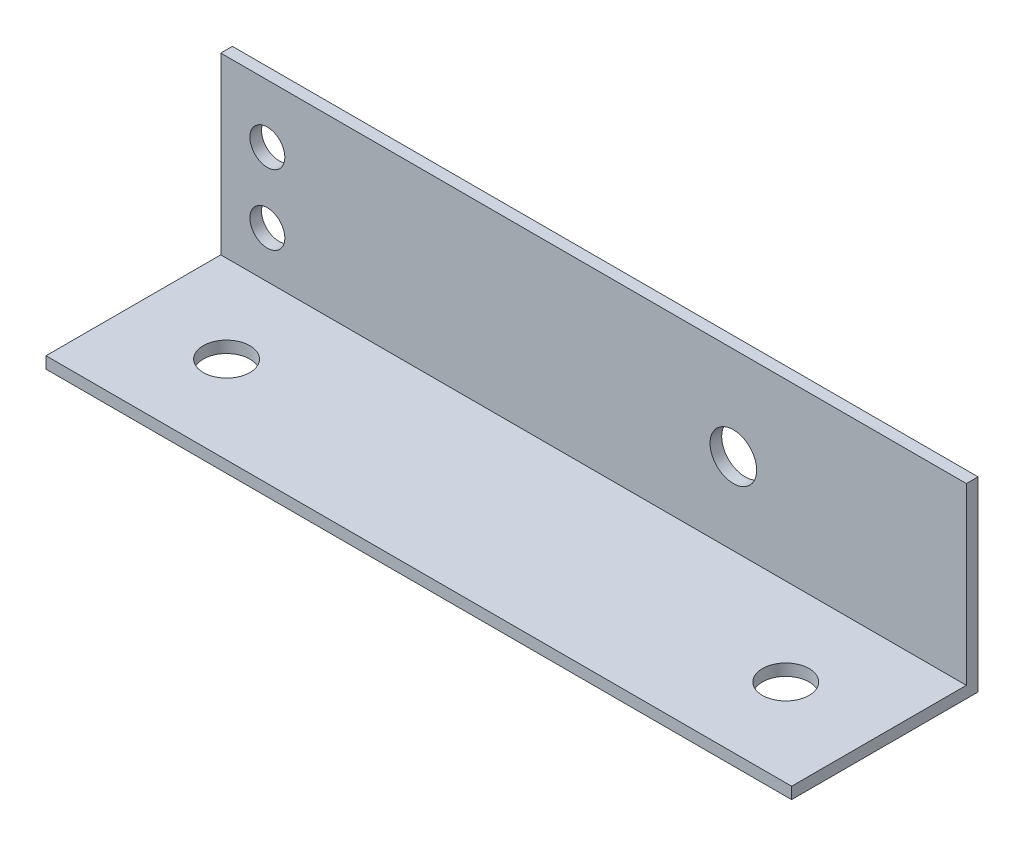
ISO-10303-21;
HEADER;
FILE_DESCRIPTION(('STEP AP214'),'2;1');
FILE_NAME('part.step','',(''),(''),'','','');
FILE_SCHEMA(('AUTOMOTIVE_DESIGN { 1 0 10303 214 1 1 1 1 }'));
ENDSEC;
DATA;
#1=APPLICATION_CONTEXT('core data for automotive mechanical design processes');
#2=APPLICATION_PROTOCOL_DEFINITION('international standard','automotive_design',2000,#1);
#3=PRODUCT_CONTEXT('',#1,'mechanical');
#4=PRODUCT('Part','Part','',(#3));
#5=PRODUCT_RELATED_PRODUCT_CATEGORY('part','',(#4));
#6=PRODUCT_DEFINITION_FORMATION('','',#4);
#7=PRODUCT_DEFINITION_CONTEXT('part definition',#1,'design');
#8=PRODUCT_DEFINITION('design','',#6,#7);
#9=PRODUCT_DEFINITION_SHAPE('','',#8);
#10=(LENGTH_UNIT() NAMED_UNIT(*) SI_UNIT(.MILLI.,.METRE.));
#11=(NAMED_UNIT(*) PLANE_ANGLE_UNIT() SI_UNIT($,.RADIAN.));
#12=(NAMED_UNIT(*) SI_UNIT($,.STERADIAN.) SOLID_ANGLE_UNIT());
#13=UNCERTAINTY_MEASURE_WITH_UNIT(LENGTH_MEASURE(1.E-05),#10,'distance_accuracy_value','');
#14=(GEOMETRIC_REPRESENTATION_CONTEXT(3) GLOBAL_UNCERTAINTY_ASSIGNED_CONTEXT((#13)) GLOBAL_UNIT_ASSIGNED_CONTEXT((#10,
#11,#12)) REPRESENTATION_CONTEXT('',''));
#15=CARTESIAN_POINT('',(0.,0.,0.));
#16=DIRECTION('',(0.,0.,1.));
#17=DIRECTION('',(1.,0.,0.));
#18=AXIS2_PLACEMENT_3D('',#15,#16,#17);
#19=CARTESIAN_POINT('',(101.6,0.,25.4));
#20=DIRECTION('',(0.,1.,0.));
#21=DIRECTION('',(0.,0.,1.));
#22=AXIS2_PLACEMENT_3D('',#19,#20,#21);
#23=PLANE('',#22);
#24=CARTESIAN_POINT('',(12.7,0.,13.49375));
#25=DIRECTION('',(0.,1.,0.));
#26=DIRECTION('',(0.,0.,1.));
#27=AXIS2_PLACEMENT_3D('',#24,#25,#26);
#28=CIRCLE('',#27,3.175);
#29=CARTESIAN_POINT('',(12.7,0.,16.66875));
#30=VERTEX_POINT('',#29);
#31=EDGE_CURVE('E123',#30,#30,#28,.T.);
#32=ORIENTED_EDGE('',*,*,#31,.T.);
#33=EDGE_LOOP('',(#32));
#34=FACE_BOUND('',#33,.T.);
#35=CARTESIAN_POINT('',(88.9,0.,13.49375));
#36=DIRECTION('',(0.,1.,0.));
#37=DIRECTION('',(0.,0.,1.));
#38=AXIS2_PLACEMENT_3D('',#35,#36,#37);
#39=CIRCLE('',#38,3.175);
#40=CARTESIAN_POINT('',(88.9,0.,16.66875));
#41=VERTEX_POINT('',#40);
#42=EDGE_CURVE('E166',#41,#41,#39,.T.);
#43=ORIENTED_EDGE('',*,*,#42,.T.);
#44=EDGE_LOOP('',(#43));
#45=FACE_BOUND('',#44,.T.);
#46=DIRECTION('',(0.,0.,-1.));
#47=VECTOR('',#46,1.);
#48=CARTESIAN_POINT('',(0.,0.,25.4));
#49=LINE('',#48,#47);
#50=CARTESIAN_POINT('',(0.,0.,25.4));
#51=VERTEX_POINT('',#50);
#52=CARTESIAN_POINT('',(0.,0.,0.));
#53=VERTEX_POINT('',#52);
#54=EDGE_CURVE('E119',#51,#53,#49,.T.);
#55=ORIENTED_EDGE('',*,*,#54,.T.);
#56=DIRECTION('',(-1.,0.,0.));
#57=VECTOR('',#56,1.);
#58=CARTESIAN_POINT('',(101.6,0.,0.));
#59=LINE('',#58,#57);
#60=CARTESIAN_POINT('',(101.6,0.,0.));
#61=VERTEX_POINT('',#60);
#62=EDGE_CURVE('E11',#61,#53,#59,.T.);
#63=ORIENTED_EDGE('',*,*,#62,.F.);
#64=DIRECTION('',(0.,0.,-1.));
#65=VECTOR('',#64,1.);
#66=CARTESIAN_POINT('',(101.6,0.,25.4));
#67=LINE('',#66,#65);
#68=CARTESIAN_POINT('',(101.6,0.,25.4));
#69=VERTEX_POINT('',#68);
#70=EDGE_CURVE('E130',#69,#61,#67,.T.);
#71=ORIENTED_EDGE('',*,*,#70,.F.);
#72=DIRECTION('',(-1.,0.,0.));
#73=VECTOR('',#72,1.);
#74=CARTESIAN_POINT('',(101.6,0.,25.4));
#75=LINE('',#74,#73);
#76=EDGE_CURVE('E115',#69,#51,#75,.T.);
#77=ORIENTED_EDGE('',*,*,#76,.T.);
#78=EDGE_LOOP('',(#55,#63,#71,#77));
#79=FACE_BOUND('',#78,.T.);
#80=ADVANCED_FACE('F35',(#34,#45,#79),#23,.F.);
#81=CARTESIAN_POINT('',(101.6,0.,0.));
#82=DIRECTION('',(0.,0.,1.));
#83=DIRECTION('',(1.,0.,0.));
#84=AXIS2_PLACEMENT_3D('',#81,#82,#83);
#85=PLANE('',#84);
#86=CARTESIAN_POINT('',(69.85,12.7,0.));
#87=DIRECTION('',(0.,0.,1.));
#88=DIRECTION('',(1.,0.,0.));
#89=AXIS2_PLACEMENT_3D('',#86,#87,#88);
#90=CIRCLE('',#89,3.175);
#91=CARTESIAN_POINT('',(73.025,12.7,0.));
#92=VERTEX_POINT('',#91);
#93=EDGE_CURVE('E178',#92,#92,#90,.T.);
#94=ORIENTED_EDGE('',*,*,#93,.T.);
#95=EDGE_LOOP('',(#94));
#96=FACE_BOUND('',#95,.T.);
#97=CARTESIAN_POINT('',(6.35,17.4625,0.));
#98=DIRECTION('',(0.,0.,1.));
#99=DIRECTION('',(1.,0.,0.));
#100=AXIS2_PLACEMENT_3D('',#97,#98,#99);
#101=CIRCLE('',#100,2.38125);
#102=CARTESIAN_POINT('',(8.73125,17.4625,0.));
#103=VERTEX_POINT('',#102);
#104=EDGE_CURVE('E182',#103,#103,#101,.T.);
#105=ORIENTED_EDGE('',*,*,#104,.T.);
#106=EDGE_LOOP('',(#105));
#107=FACE_BOUND('',#106,.T.);
#108=CARTESIAN_POINT('',(6.35,7.9375,0.));
#109=DIRECTION('',(0.,0.,1.));
#110=DIRECTION('',(1.,0.,0.));
#111=AXIS2_PLACEMENT_3D('',#108,#109,#110);
#112=CIRCLE('',#111,2.38125);
#113=CARTESIAN_POINT('',(8.73125,7.9375,0.));
#114=VERTEX_POINT('',#113);
#115=EDGE_CURVE('E185',#114,#114,#112,.T.);
#116=ORIENTED_EDGE('',*,*,#115,.T.);
#117=EDGE_LOOP('',(#116));
#118=FACE_BOUND('',#117,.T.);
#119=DIRECTION('',(0.,1.,0.));
#120=VECTOR('',#119,1.);
#121=CARTESIAN_POINT('',(0.,0.,0.));
#122=LINE('',#121,#120);
#123=CARTESIAN_POINT('',(0.,25.4,0.));
#124=VERTEX_POINT('',#123);
#125=EDGE_CURVE('E122',#53,#124,#122,.T.);
#126=ORIENTED_EDGE('',*,*,#125,.T.);
#127=DIRECTION('',(-1.,0.,0.));
#128=VECTOR('',#127,1.);
#129=CARTESIAN_POINT('',(101.6,25.4,0.));
#130=LINE('',#129,#128);
#131=CARTESIAN_POINT('',(101.6,25.4,0.));
#132=VERTEX_POINT('',#131);
#133=EDGE_CURVE('E43',#132,#124,#130,.T.);
#134=ORIENTED_EDGE('',*,*,#133,.F.);
#135=DIRECTION('',(0.,1.,0.));
#136=VECTOR('',#135,1.);
#137=CARTESIAN_POINT('',(101.6,0.,0.));
#138=LINE('',#137,#136);
#139=EDGE_CURVE('E88',#61,#132,#138,.T.);
#140=ORIENTED_EDGE('',*,*,#139,.F.);
#141=ORIENTED_EDGE('',*,*,#62,.T.);
#142=EDGE_LOOP('',(#126,#134,#140,#141));
#143=FACE_BOUND('',#142,.T.);
#144=ADVANCED_FACE('F155',(#96,#107,#118,#143),#85,.F.);
#145=CARTESIAN_POINT('',(101.6,25.4,0.));
#146=DIRECTION('',(0.,-1.,0.));
#147=DIRECTION('',(0.,0.,-1.));
#148=AXIS2_PLACEMENT_3D('',#145,#146,#147);
#149=PLANE('',#148);
#150=DIRECTION('',(0.,0.,1.));
#151=VECTOR('',#150,1.);
#152=CARTESIAN_POINT('',(0.,25.4,0.));
#153=LINE('',#152,#151);
#154=CARTESIAN_POINT('',(0.,25.4,1.5875));
#155=VERTEX_POINT('',#154);
#156=EDGE_CURVE('E125',#124,#155,#153,.T.);
#157=ORIENTED_EDGE('',*,*,#156,.T.);
#158=DIRECTION('',(-1.,0.,0.));
#159=VECTOR('',#158,1.);
#160=CARTESIAN_POINT('',(101.6,25.4,1.5875));
#161=LINE('',#160,#159);
#162=CARTESIAN_POINT('',(101.6,25.4,1.5875));
#163=VERTEX_POINT('',#162);
#164=EDGE_CURVE('E110',#163,#155,#161,.T.);
#165=ORIENTED_EDGE('',*,*,#164,.F.);
#166=DIRECTION('',(0.,0.,1.));
#167=VECTOR('',#166,1.);
#168=CARTESIAN_POINT('',(101.6,25.4,0.));
#169=LINE('',#168,#167);
#170=EDGE_CURVE('E101',#132,#163,#169,.T.);
#171=ORIENTED_EDGE('',*,*,#170,.F.);
#172=ORIENTED_EDGE('',*,*,#133,.T.);
#173=EDGE_LOOP('',(#157,#165,#171,#172));
#174=FACE_BOUND('',#173,.T.);
#175=ADVANCED_FACE('F136',(#174),#149,.F.);
#176=CARTESIAN_POINT('',(101.6,25.4,1.5875));
#177=DIRECTION('',(0.,0.,-1.));
#178=DIRECTION('',(0.,1.,0.));
#179=AXIS2_PLACEMENT_3D('',#176,#177,#178);
#180=PLANE('',#179);
#181=CARTESIAN_POINT('',(69.85,12.7,1.5875));
#182=DIRECTION('',(0.,0.,1.));
#183=DIRECTION('',(1.,0.,0.));
#184=AXIS2_PLACEMENT_3D('',#181,#182,#183);
#185=CIRCLE('',#184,3.175);
#186=CARTESIAN_POINT('',(73.025,12.7,1.5875));
#187=VERTEX_POINT('',#186);
#188=EDGE_CURVE('E188',#187,#187,#185,.T.);
#189=ORIENTED_EDGE('',*,*,#188,.F.);
#190=EDGE_LOOP('',(#189));
#191=FACE_BOUND('',#190,.T.);
#192=CARTESIAN_POINT('',(6.35,17.4625,1.5875));
#193=DIRECTION('',(0.,0.,1.));
#194=DIRECTION('',(1.,0.,0.));
#195=AXIS2_PLACEMENT_3D('',#192,#193,#194);
#196=CIRCLE('',#195,2.38125);
#197=CARTESIAN_POINT('',(8.73125,17.4625,1.5875));
#198=VERTEX_POINT('',#197);
#199=EDGE_CURVE('E192',#198,#198,#196,.T.);
#200=ORIENTED_EDGE('',*,*,#199,.F.);
#201=EDGE_LOOP('',(#200));
#202=FACE_BOUND('',#201,.T.);
#203=CARTESIAN_POINT('',(6.35,7.9375,1.5875));
#204=DIRECTION('',(0.,0.,1.));
#205=DIRECTION('',(1.,0.,0.));
#206=AXIS2_PLACEMENT_3D('',#203,#204,#205);
#207=CIRCLE('',#206,2.38125);
#208=CARTESIAN_POINT('',(8.73125,7.9375,1.5875));
#209=VERTEX_POINT('',#208);
#210=EDGE_CURVE('E189',#209,#209,#207,.T.);
#211=ORIENTED_EDGE('',*,*,#210,.F.);
#212=EDGE_LOOP('',(#211));
#213=FACE_BOUND('',#212,.T.);
#214=DIRECTION('',(0.,-1.,0.));
#215=VECTOR('',#214,1.);
#216=CARTESIAN_POINT('',(0.,25.4,1.5875));
#217=LINE('',#216,#215);
#218=CARTESIAN_POINT('',(0.,1.5875,1.5875));
#219=VERTEX_POINT('',#218);
#220=EDGE_CURVE('E109',#155,#219,#217,.T.);
#221=ORIENTED_EDGE('',*,*,#220,.T.);
#222=DIRECTION('',(-1.,0.,0.));
#223=VECTOR('',#222,1.);
#224=CARTESIAN_POINT('',(101.6,1.5875,1.5875));
#225=LINE('',#224,#223);
#226=CARTESIAN_POINT('',(101.6,1.5875,1.5875));
#227=VERTEX_POINT('',#226);
#228=EDGE_CURVE('E106',#227,#219,#225,.T.);
#229=ORIENTED_EDGE('',*,*,#228,.F.);
#230=DIRECTION('',(0.,-1.,0.));
#231=VECTOR('',#230,1.);
#232=CARTESIAN_POINT('',(101.6,25.4,1.5875));
#233=LINE('',#232,#231);
#234=EDGE_CURVE('E95',#163,#227,#233,.T.);
#235=ORIENTED_EDGE('',*,*,#234,.F.);
#236=ORIENTED_EDGE('',*,*,#164,.T.);
#237=EDGE_LOOP('',(#221,#229,#235,#236));
#238=FACE_BOUND('',#237,.T.);
#239=ADVANCED_FACE('F107',(#191,#202,#213,#238),#180,.F.);
#240=CARTESIAN_POINT('',(101.6,1.5875,1.5875));
#241=DIRECTION('',(0.,-1.,0.));
#242=DIRECTION('',(0.,0.,-1.));
#243=AXIS2_PLACEMENT_3D('',#240,#241,#242);
#244=PLANE('',#243);
#245=CARTESIAN_POINT('',(12.7,1.5875,13.49375));
#246=DIRECTION('',(0.,1.,0.));
#247=DIRECTION('',(0.,0.,1.));
#248=AXIS2_PLACEMENT_3D('',#245,#246,#247);
#249=CIRCLE('',#248,3.175);
#250=CARTESIAN_POINT('',(12.7,1.5875,16.66875));
#251=VERTEX_POINT('',#250);
#252=EDGE_CURVE('E168',#251,#251,#249,.T.);
#253=ORIENTED_EDGE('',*,*,#252,.F.);
#254=EDGE_LOOP('',(#253));
#255=FACE_BOUND('',#254,.T.);
#256=CARTESIAN_POINT('',(88.9,1.5875,13.49375));
#257=DIRECTION('',(0.,1.,0.));
#258=DIRECTION('',(0.,0.,1.));
#259=AXIS2_PLACEMENT_3D('',#256,#257,#258);
#260=CIRCLE('',#259,3.175);
#261=CARTESIAN_POINT('',(88.9,1.5875,16.66875));
#262=VERTEX_POINT('',#261);
#263=EDGE_CURVE('E172',#262,#262,#260,.T.);
#264=ORIENTED_EDGE('',*,*,#263,.F.);
#265=EDGE_LOOP('',(#264));
#266=FACE_BOUND('',#265,.T.);
#267=DIRECTION('',(0.,0.,1.));
#268=VECTOR('',#267,1.);
#269=CARTESIAN_POINT('',(0.,1.5875,1.5875));
#270=LINE('',#269,#268);
#271=CARTESIAN_POINT('',(0.,1.5875,25.4));
#272=VERTEX_POINT('',#271);
#273=EDGE_CURVE('E74',#219,#272,#270,.T.);
#274=ORIENTED_EDGE('',*,*,#273,.T.);
#275=DIRECTION('',(-1.,0.,0.));
#276=VECTOR('',#275,1.);
#277=CARTESIAN_POINT('',(101.6,1.5875,25.4));
#278=LINE('',#277,#276);
#279=CARTESIAN_POINT('',(101.6,1.5875,25.4));
#280=VERTEX_POINT('',#279);
#281=EDGE_CURVE('E111',#280,#272,#278,.T.);
#282=ORIENTED_EDGE('',*,*,#281,.F.);
#283=DIRECTION('',(0.,0.,1.));
#284=VECTOR('',#283,1.);
#285=CARTESIAN_POINT('',(101.6,1.5875,1.5875));
#286=LINE('',#285,#284);
#287=EDGE_CURVE('E99',#227,#280,#286,.T.);
#288=ORIENTED_EDGE('',*,*,#287,.F.);
#289=ORIENTED_EDGE('',*,*,#228,.T.);
#290=EDGE_LOOP('',(#274,#282,#288,#289));
#291=FACE_BOUND('',#290,.T.);
#292=ADVANCED_FACE('F113',(#255,#266,#291),#244,.F.);
#293=CARTESIAN_POINT('',(101.6,1.5875,25.4));
#294=DIRECTION('',(0.,0.,-1.));
#295=DIRECTION('',(-1.,0.,0.));
#296=AXIS2_PLACEMENT_3D('',#293,#294,#295);
#297=PLANE('',#296);
#298=DIRECTION('',(0.,-1.,0.));
#299=VECTOR('',#298,1.);
#300=CARTESIAN_POINT('',(0.,1.5875,25.4));
#301=LINE('',#300,#299);
#302=EDGE_CURVE('E80',#272,#51,#301,.T.);
#303=ORIENTED_EDGE('',*,*,#302,.T.);
#304=ORIENTED_EDGE('',*,*,#76,.F.);
#305=DIRECTION('',(0.,-1.,0.));
#306=VECTOR('',#305,1.);
#307=CARTESIAN_POINT('',(101.6,1.5875,25.4));
#308=LINE('',#307,#306);
#309=EDGE_CURVE('E51',#280,#69,#308,.T.);
#310=ORIENTED_EDGE('',*,*,#309,.F.);
#311=ORIENTED_EDGE('',*,*,#281,.T.);
#312=EDGE_LOOP('',(#303,#304,#310,#311));
#313=FACE_BOUND('',#312,.T.);
#314=ADVANCED_FACE('F143',(#313),#297,.F.);
#315=CARTESIAN_POINT('',(101.6,0.,0.));
#316=DIRECTION('',(1.,0.,0.));
#317=DIRECTION('',(0.,0.,-1.));
#318=AXIS2_PLACEMENT_3D('',#315,#316,#317);
#319=PLANE('',#318);
#320=ORIENTED_EDGE('',*,*,#70,.T.);
#321=ORIENTED_EDGE('',*,*,#139,.T.);
#322=ORIENTED_EDGE('',*,*,#170,.T.);
#323=ORIENTED_EDGE('',*,*,#234,.T.);
#324=ORIENTED_EDGE('',*,*,#287,.T.);
#325=ORIENTED_EDGE('',*,*,#309,.T.);
#326=EDGE_LOOP('',(#320,#321,#322,#323,#324,#325));
#327=FACE_BOUND('',#326,.T.);
#328=ADVANCED_FACE('F97',(#327),#319,.T.);
#329=CARTESIAN_POINT('',(0.,0.,0.));
#330=DIRECTION('',(1.,0.,0.));
#331=DIRECTION('',(0.,0.,-1.));
#332=AXIS2_PLACEMENT_3D('',#329,#330,#331);
#333=PLANE('',#332);
#334=ORIENTED_EDGE('',*,*,#54,.F.);
#335=ORIENTED_EDGE('',*,*,#302,.F.);
#336=ORIENTED_EDGE('',*,*,#273,.F.);
#337=ORIENTED_EDGE('',*,*,#220,.F.);
#338=ORIENTED_EDGE('',*,*,#156,.F.);
#339=ORIENTED_EDGE('',*,*,#125,.F.);
#340=EDGE_LOOP('',(#334,#335,#336,#337,#338,#339));
#341=FACE_BOUND('',#340,.T.);
#342=ADVANCED_FACE('F139',(#341),#333,.F.);
#343=CARTESIAN_POINT('',(88.9,-100.0125,13.49375));
#344=DIRECTION('',(0.,1.,0.));
#345=DIRECTION('',(0.,0.,1.));
#346=AXIS2_PLACEMENT_3D('',#343,#344,#345);
#347=CYLINDRICAL_SURFACE('',#346,3.175);
#348=ORIENTED_EDGE('',*,*,#263,.T.);
#349=EDGE_LOOP('',(#348));
#350=FACE_BOUND('',#349,.T.);
#351=ORIENTED_EDGE('',*,*,#42,.F.);
#352=EDGE_LOOP('',(#351));
#353=FACE_BOUND('',#352,.T.);
#354=ADVANCED_FACE('F222',(#350,#353),#347,.F.);
#355=CARTESIAN_POINT('',(12.7,-100.0125,13.49375));
#356=DIRECTION('',(0.,1.,0.));
#357=DIRECTION('',(0.,0.,1.));
#358=AXIS2_PLACEMENT_3D('',#355,#356,#357);
#359=CYLINDRICAL_SURFACE('',#358,3.175);
#360=ORIENTED_EDGE('',*,*,#252,.T.);
#361=EDGE_LOOP('',(#360));
#362=FACE_BOUND('',#361,.T.);
#363=ORIENTED_EDGE('',*,*,#31,.F.);
#364=EDGE_LOOP('',(#363));
#365=FACE_BOUND('',#364,.T.);
#366=ADVANCED_FACE('F212',(#362,#365),#359,.F.);
#367=CARTESIAN_POINT('',(6.35,7.9375,-100.0125));
#368=DIRECTION('',(0.,0.,1.));
#369=DIRECTION('',(1.,0.,0.));
#370=AXIS2_PLACEMENT_3D('',#367,#368,#369);
#371=CYLINDRICAL_SURFACE('',#370,2.38125);
#372=ORIENTED_EDGE('',*,*,#210,.T.);
#373=EDGE_LOOP('',(#372));
#374=FACE_BOUND('',#373,.T.);
#375=ORIENTED_EDGE('',*,*,#115,.F.);
#376=EDGE_LOOP('',(#375));
#377=FACE_BOUND('',#376,.T.);
#378=ADVANCED_FACE('F208',(#374,#377),#371,.F.);
#379=CARTESIAN_POINT('',(6.35,17.4625,-100.0125));
#380=DIRECTION('',(0.,0.,1.));
#381=DIRECTION('',(1.,0.,0.));
#382=AXIS2_PLACEMENT_3D('',#379,#380,#381);
#383=CYLINDRICAL_SURFACE('',#382,2.38125);
#384=ORIENTED_EDGE('',*,*,#199,.T.);
#385=EDGE_LOOP('',(#384));
#386=FACE_BOUND('',#385,.T.);
#387=ORIENTED_EDGE('',*,*,#104,.F.);
#388=EDGE_LOOP('',(#387));
#389=FACE_BOUND('',#388,.T.);
#390=ADVANCED_FACE('F211',(#386,#389),#383,.F.);
#391=CARTESIAN_POINT('',(69.85,12.7,-100.0125));
#392=DIRECTION('',(0.,0.,1.));
#393=DIRECTION('',(1.,0.,0.));
#394=AXIS2_PLACEMENT_3D('',#391,#392,#393);
#395=CYLINDRICAL_SURFACE('',#394,3.175);
#396=ORIENTED_EDGE('',*,*,#188,.T.);
#397=EDGE_LOOP('',(#396));
#398=FACE_BOUND('',#397,.T.);
#399=ORIENTED_EDGE('',*,*,#93,.F.);
#400=EDGE_LOOP('',(#399));
#401=FACE_BOUND('',#400,.T.);
#402=ADVANCED_FACE('F198',(#398,#401),#395,.F.);
#403=CLOSED_SHELL('',(#80,#144,#175,#239,#292,#314,#328,#342,#354,#366,#378,#390,#402));
#404=MANIFOLD_SOLID_BREP('B2',#403);
#405=ADVANCED_BREP_SHAPE_REPRESENTATION('',(#18,#404),#14);
#406=SHAPE_DEFINITION_REPRESENTATION(#9,#405);
ENDSEC;
END-ISO-10303-21;
